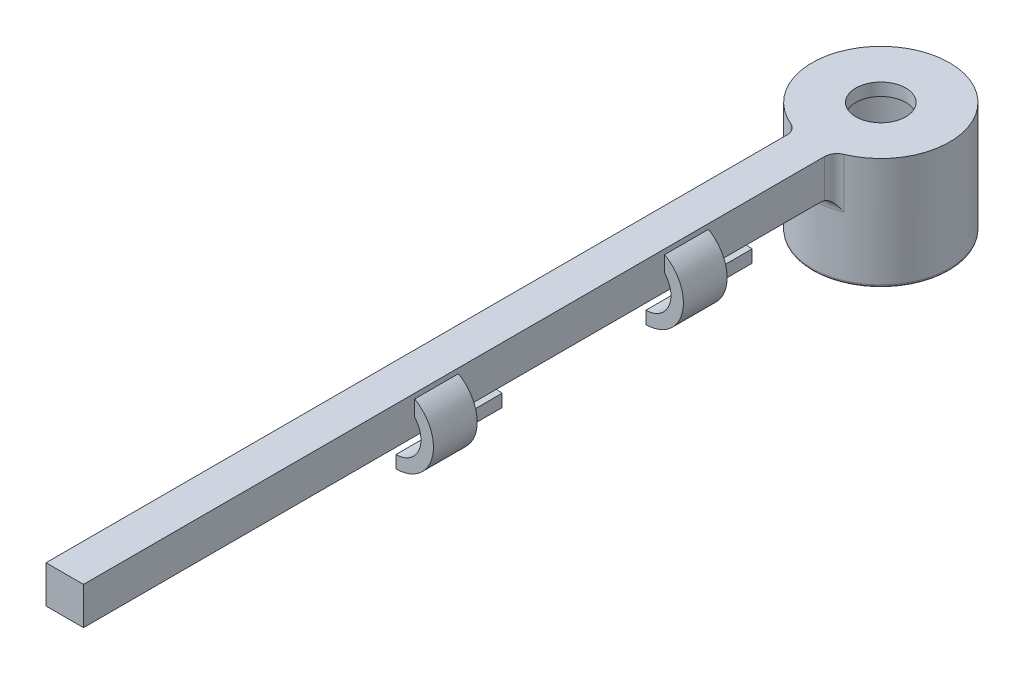
ISO-10303-21;
HEADER;
FILE_DESCRIPTION(('STEP AP214'),'2;1');
FILE_NAME('part.step','',(''),(''),'','','');
FILE_SCHEMA(('AUTOMOTIVE_DESIGN { 1 0 10303 214 1 1 1 1 }'));
ENDSEC;
DATA;
#1=APPLICATION_CONTEXT('core data for automotive mechanical design processes');
#2=APPLICATION_PROTOCOL_DEFINITION('international standard','automotive_design',2000,#1);
#3=PRODUCT_CONTEXT('',#1,'mechanical');
#4=PRODUCT('Part','Part','',(#3));
#5=PRODUCT_RELATED_PRODUCT_CATEGORY('part','',(#4));
#6=PRODUCT_DEFINITION_FORMATION('','',#4);
#7=PRODUCT_DEFINITION_CONTEXT('part definition',#1,'design');
#8=PRODUCT_DEFINITION('design','',#6,#7);
#9=PRODUCT_DEFINITION_SHAPE('','',#8);
#10=(LENGTH_UNIT() NAMED_UNIT(*) SI_UNIT(.MILLI.,.METRE.));
#11=(NAMED_UNIT(*) PLANE_ANGLE_UNIT() SI_UNIT($,.RADIAN.));
#12=(NAMED_UNIT(*) SI_UNIT($,.STERADIAN.) SOLID_ANGLE_UNIT());
#13=UNCERTAINTY_MEASURE_WITH_UNIT(LENGTH_MEASURE(1.E-05),#10,'distance_accuracy_value','');
#14=(GEOMETRIC_REPRESENTATION_CONTEXT(3) GLOBAL_UNCERTAINTY_ASSIGNED_CONTEXT((#13)) GLOBAL_UNIT_ASSIGNED_CONTEXT((#10,
#11,#12)) REPRESENTATION_CONTEXT('',''));
#15=CARTESIAN_POINT('',(0.,0.,0.));
#16=DIRECTION('',(0.,0.,1.));
#17=DIRECTION('',(1.,0.,0.));
#18=AXIS2_PLACEMENT_3D('',#15,#16,#17);
#19=CARTESIAN_POINT('',(0.,-9.,0.));
#20=DIRECTION('',(0.,1.,0.));
#21=DIRECTION('',(0.,0.,1.));
#22=AXIS2_PLACEMENT_3D('',#19,#20,#21);
#23=CYLINDRICAL_SURFACE('',#22,5.5);
#24=CARTESIAN_POINT('',(0.,-8.75,0.));
#25=DIRECTION('',(0.,1.,0.));
#26=DIRECTION('',(0.,0.,1.));
#27=AXIS2_PLACEMENT_3D('',#24,#25,#26);
#28=CIRCLE('',#27,5.5);
#29=CARTESIAN_POINT('',(0.,-8.75,5.5));
#30=VERTEX_POINT('',#29);
#31=EDGE_CURVE('E401',#30,#30,#28,.T.);
#32=ORIENTED_EDGE('',*,*,#31,.T.);
#33=EDGE_LOOP('',(#32));
#34=FACE_BOUND('',#33,.T.);
#35=DIRECTION('',(0.,1.,0.));
#36=VECTOR('',#35,1.);
#37=CARTESIAN_POINT('',(2.11538461538462,-9.,5.07692307692308));
#38=LINE('',#37,#36);
#39=CARTESIAN_POINT('',(2.11538461538462,0.,5.07692307692308));
#40=VERTEX_POINT('',#39);
#41=CARTESIAN_POINT('',(2.11538461538462,-4.,5.07692307692308));
#42=VERTEX_POINT('',#41);
#43=EDGE_CURVE('E313',#40,#42,#38,.F.);
#44=ORIENTED_EDGE('',*,*,#43,.T.);
#45=CARTESIAN_POINT('',(0.,-4.,0.));
#46=DIRECTION('',(0.,-1.,0.));
#47=DIRECTION('',(0.,0.,-1.));
#48=AXIS2_PLACEMENT_3D('',#45,#46,#47);
#49=CIRCLE('',#48,5.5);
#50=CARTESIAN_POINT('',(-2.11538461538461,-4.,5.07692307692308));
#51=VERTEX_POINT('',#50);
#52=EDGE_CURVE('E326',#42,#51,#49,.T.);
#53=ORIENTED_EDGE('',*,*,#52,.T.);
#54=DIRECTION('',(0.,1.,0.));
#55=VECTOR('',#54,1.);
#56=CARTESIAN_POINT('',(-2.11538461538461,-9.,5.07692307692308));
#57=LINE('',#56,#55);
#58=CARTESIAN_POINT('',(-2.11538461538461,0.,5.07692307692308));
#59=VERTEX_POINT('',#58);
#60=EDGE_CURVE('E319',#51,#59,#57,.T.);
#61=ORIENTED_EDGE('',*,*,#60,.T.);
#62=CARTESIAN_POINT('',(0.,0.,0.));
#63=DIRECTION('',(0.,1.,0.));
#64=DIRECTION('',(0.,0.,1.));
#65=AXIS2_PLACEMENT_3D('',#62,#63,#64);
#66=CIRCLE('',#65,5.5);
#67=EDGE_CURVE('E307',#40,#59,#66,.T.);
#68=ORIENTED_EDGE('',*,*,#67,.F.);
#69=EDGE_LOOP('',(#44,#53,#61,#68));
#70=FACE_BOUND('',#69,.T.);
#71=ADVANCED_FACE('F33',(#34,#70),#23,.T.);
#72=CARTESIAN_POINT('',(0.,-9.,0.));
#73=DIRECTION('',(0.,1.,0.));
#74=DIRECTION('',(0.,0.,1.));
#75=AXIS2_PLACEMENT_3D('',#72,#73,#74);
#76=PLANE('',#75);
#77=CARTESIAN_POINT('',(0.,-9.,0.));
#78=DIRECTION('',(0.,1.,0.));
#79=DIRECTION('',(0.,0.,1.));
#80=AXIS2_PLACEMENT_3D('',#77,#78,#79);
#81=CIRCLE('',#80,4.63);
#82=CARTESIAN_POINT('',(0.,-9.,4.63));
#83=VERTEX_POINT('',#82);
#84=EDGE_CURVE('E410',#83,#83,#81,.T.);
#85=ORIENTED_EDGE('',*,*,#84,.T.);
#86=EDGE_LOOP('',(#85));
#87=FACE_BOUND('',#86,.T.);
#88=CARTESIAN_POINT('',(0.,-9.,0.));
#89=DIRECTION('',(0.,1.,0.));
#90=DIRECTION('',(0.,0.,1.));
#91=AXIS2_PLACEMENT_3D('',#88,#89,#90);
#92=CIRCLE('',#91,5.25);
#93=CARTESIAN_POINT('',(0.,-9.,5.25));
#94=VERTEX_POINT('',#93);
#95=EDGE_CURVE('E404',#94,#94,#92,.F.);
#96=ORIENTED_EDGE('',*,*,#95,.T.);
#97=EDGE_LOOP('',(#96));
#98=FACE_BOUND('',#97,.T.);
#99=ADVANCED_FACE('F373',(#87,#98),#76,.F.);
#100=CARTESIAN_POINT('',(0.,0.,0.));
#101=DIRECTION('',(0.,1.,0.));
#102=DIRECTION('',(0.,0.,1.));
#103=AXIS2_PLACEMENT_3D('',#100,#101,#102);
#104=PLANE('',#103);
#105=DIRECTION('',(0.,0.,-1.));
#106=VECTOR('',#105,1.);
#107=CARTESIAN_POINT('',(1.5,0.,5.29150262212918));
#108=LINE('',#107,#106);
#109=CARTESIAN_POINT('',(1.5,0.,65.2915026221292));
#110=VERTEX_POINT('',#109);
#111=CARTESIAN_POINT('',(1.5,0.,6.));
#112=VERTEX_POINT('',#111);
#113=EDGE_CURVE('E289',#110,#112,#108,.T.);
#114=ORIENTED_EDGE('',*,*,#113,.T.);
#115=CARTESIAN_POINT('',(2.5,0.,6.));
#116=DIRECTION('',(0.,1.,0.));
#117=DIRECTION('',(0.,0.,1.));
#118=AXIS2_PLACEMENT_3D('',#115,#116,#117);
#119=CIRCLE('',#118,1.);
#120=EDGE_CURVE('E315',#112,#40,#119,.F.);
#121=ORIENTED_EDGE('',*,*,#120,.T.);
#122=ORIENTED_EDGE('',*,*,#67,.T.);
#123=CARTESIAN_POINT('',(-2.49999999999999,0.,6.));
#124=DIRECTION('',(0.,1.,0.));
#125=DIRECTION('',(0.,0.,1.));
#126=AXIS2_PLACEMENT_3D('',#123,#124,#125);
#127=CIRCLE('',#126,1.);
#128=CARTESIAN_POINT('',(-1.49999999999999,0.,6.));
#129=VERTEX_POINT('',#128);
#130=EDGE_CURVE('E321',#59,#129,#127,.F.);
#131=ORIENTED_EDGE('',*,*,#130,.T.);
#132=DIRECTION('',(0.,0.,1.));
#133=VECTOR('',#132,1.);
#134=CARTESIAN_POINT('',(-1.49999999999999,0.,5.29150262212918));
#135=LINE('',#134,#133);
#136=CARTESIAN_POINT('',(-1.49999999999999,0.,65.2915026221292));
#137=VERTEX_POINT('',#136);
#138=EDGE_CURVE('E281',#129,#137,#135,.T.);
#139=ORIENTED_EDGE('',*,*,#138,.T.);
#140=DIRECTION('',(1.,0.,0.));
#141=VECTOR('',#140,1.);
#142=CARTESIAN_POINT('',(-1.49999999999999,0.,65.2915026221292));
#143=LINE('',#142,#141);
#144=EDGE_CURVE('E276',#137,#110,#143,.T.);
#145=ORIENTED_EDGE('',*,*,#144,.T.);
#146=EDGE_LOOP('',(#114,#121,#122,#131,#139,#145));
#147=FACE_BOUND('',#146,.T.);
#148=CARTESIAN_POINT('',(0.,0.,0.));
#149=DIRECTION('',(0.,1.,0.));
#150=DIRECTION('',(0.,0.,1.));
#151=AXIS2_PLACEMENT_3D('',#148,#149,#150);
#152=CIRCLE('',#151,2.);
#153=CARTESIAN_POINT('',(0.,0.,2.));
#154=VERTEX_POINT('',#153);
#155=EDGE_CURVE('E296',#154,#154,#152,.T.);
#156=ORIENTED_EDGE('',*,*,#155,.F.);
#157=EDGE_LOOP('',(#156));
#158=FACE_BOUND('',#157,.T.);
#159=ADVANCED_FACE('F371',(#147,#158),#104,.T.);
#160=CARTESIAN_POINT('',(0.,-0.999999999999999,0.));
#161=DIRECTION('',(0.,-1.,0.));
#162=DIRECTION('',(0.,0.,-1.));
#163=AXIS2_PLACEMENT_3D('',#160,#161,#162);
#164=CYLINDRICAL_SURFACE('',#163,4.38);
#165=CARTESIAN_POINT('',(0.,-8.75,0.));
#166=DIRECTION('',(0.,1.,0.));
#167=DIRECTION('',(0.,0.,1.));
#168=AXIS2_PLACEMENT_3D('',#165,#166,#167);
#169=CIRCLE('',#168,4.38);
#170=CARTESIAN_POINT('',(0.,-8.75,4.38));
#171=VERTEX_POINT('',#170);
#172=EDGE_CURVE('E407',#171,#171,#169,.F.);
#173=ORIENTED_EDGE('',*,*,#172,.T.);
#174=EDGE_LOOP('',(#173));
#175=FACE_BOUND('',#174,.T.);
#176=CARTESIAN_POINT('',(0.,-0.999999999999999,0.));
#177=DIRECTION('',(0.,-1.,0.));
#178=DIRECTION('',(0.,0.,-1.));
#179=AXIS2_PLACEMENT_3D('',#176,#177,#178);
#180=CIRCLE('',#179,4.38);
#181=CARTESIAN_POINT('',(0.,-0.999999999999999,-4.38));
#182=VERTEX_POINT('',#181);
#183=EDGE_CURVE('E302',#182,#182,#180,.T.);
#184=ORIENTED_EDGE('',*,*,#183,.F.);
#185=EDGE_LOOP('',(#184));
#186=FACE_BOUND('',#185,.T.);
#187=ADVANCED_FACE('F367',(#175,#186),#164,.F.);
#188=CARTESIAN_POINT('',(0.,-0.999999999999999,0.));
#189=DIRECTION('',(0.,-1.,0.));
#190=DIRECTION('',(0.,0.,-1.));
#191=AXIS2_PLACEMENT_3D('',#188,#189,#190);
#192=PLANE('',#191);
#193=CARTESIAN_POINT('',(0.,-1.,0.));
#194=DIRECTION('',(0.,1.,0.));
#195=DIRECTION('',(0.,0.,1.));
#196=AXIS2_PLACEMENT_3D('',#193,#194,#195);
#197=CIRCLE('',#196,2.);
#198=CARTESIAN_POINT('',(0.,-1.,2.));
#199=VERTEX_POINT('',#198);
#200=EDGE_CURVE('E299',#199,#199,#197,.T.);
#201=ORIENTED_EDGE('',*,*,#200,.T.);
#202=EDGE_LOOP('',(#201));
#203=FACE_BOUND('',#202,.T.);
#204=ORIENTED_EDGE('',*,*,#183,.T.);
#205=EDGE_LOOP('',(#204));
#206=FACE_BOUND('',#205,.T.);
#207=ADVANCED_FACE('F363',(#203,#206),#192,.T.);
#208=CARTESIAN_POINT('',(0.,-1.,0.));
#209=DIRECTION('',(0.,1.,0.));
#210=DIRECTION('',(0.,0.,1.));
#211=AXIS2_PLACEMENT_3D('',#208,#209,#210);
#212=CYLINDRICAL_SURFACE('',#211,2.);
#213=ORIENTED_EDGE('',*,*,#200,.F.);
#214=EDGE_LOOP('',(#213));
#215=FACE_BOUND('',#214,.T.);
#216=ORIENTED_EDGE('',*,*,#155,.T.);
#217=EDGE_LOOP('',(#216));
#218=FACE_BOUND('',#217,.T.);
#219=ADVANCED_FACE('F359',(#215,#218),#212,.F.);
#220=CARTESIAN_POINT('',(-1.49999999999999,-3.,65.2915026221292));
#221=DIRECTION('',(0.,0.,1.));
#222=DIRECTION('',(1.,0.,0.));
#223=AXIS2_PLACEMENT_3D('',#220,#221,#222);
#224=PLANE('',#223);
#225=ORIENTED_EDGE('',*,*,#144,.F.);
#226=DIRECTION('',(0.,1.,0.));
#227=VECTOR('',#226,1.);
#228=CARTESIAN_POINT('',(-1.49999999999999,-3.,65.2915026221292));
#229=LINE('',#228,#227);
#230=CARTESIAN_POINT('',(-1.49999999999999,-3.,65.2915026221292));
#231=VERTEX_POINT('',#230);
#232=EDGE_CURVE('E293',#231,#137,#229,.T.);
#233=ORIENTED_EDGE('',*,*,#232,.F.);
#234=DIRECTION('',(1.,0.,0.));
#235=VECTOR('',#234,1.);
#236=CARTESIAN_POINT('',(-1.49999999999999,-3.,65.2915026221292));
#237=LINE('',#236,#235);
#238=CARTESIAN_POINT('',(1.5,-3.,65.2915026221292));
#239=VERTEX_POINT('',#238);
#240=EDGE_CURVE('E277',#231,#239,#237,.T.);
#241=ORIENTED_EDGE('',*,*,#240,.T.);
#242=DIRECTION('',(0.,1.,0.));
#243=VECTOR('',#242,1.);
#244=CARTESIAN_POINT('',(1.5,-3.,65.2915026221292));
#245=LINE('',#244,#243);
#246=EDGE_CURVE('E286',#239,#110,#245,.T.);
#247=ORIENTED_EDGE('',*,*,#246,.T.);
#248=EDGE_LOOP('',(#225,#233,#241,#247));
#249=FACE_BOUND('',#248,.T.);
#250=ADVANCED_FACE('F356',(#249),#224,.T.);
#251=CARTESIAN_POINT('',(-1.49999999999999,-3.,5.29150262212918));
#252=DIRECTION('',(-1.,0.,0.));
#253=DIRECTION('',(0.,0.,1.));
#254=AXIS2_PLACEMENT_3D('',#251,#252,#253);
#255=PLANE('',#254);
#256=DIRECTION('',(0.,1.,0.));
#257=VECTOR('',#256,1.);
#258=CARTESIAN_POINT('',(-1.49999999999999,-3.,33.7915026221292));
#259=LINE('',#258,#257);
#260=CARTESIAN_POINT('',(-1.49999999999999,-1.6771243444677,33.7915026221292));
#261=VERTEX_POINT('',#260);
#262=CARTESIAN_POINT('',(-1.49999999999999,-0.401923788646679,33.7915026221292));
#263=VERTEX_POINT('',#262);
#264=EDGE_CURVE('E11',#261,#263,#259,.T.);
#265=ORIENTED_EDGE('',*,*,#264,.F.);
#266=DIRECTION('',(0.,0.,-1.));
#267=VECTOR('',#266,1.);
#268=CARTESIAN_POINT('',(-1.49999999999999,-1.6771243444677,33.7915026221292));
#269=LINE('',#268,#267);
#270=CARTESIAN_POINT('',(-1.49999999999999,-1.6771243444677,30.2915026221292));
#271=VERTEX_POINT('',#270);
#272=EDGE_CURVE('E41',#261,#271,#269,.T.);
#273=ORIENTED_EDGE('',*,*,#272,.T.);
#274=DIRECTION('',(0.,1.,0.));
#275=VECTOR('',#274,1.);
#276=CARTESIAN_POINT('',(-1.49999999999999,-3.,30.2915026221292));
#277=LINE('',#276,#275);
#278=CARTESIAN_POINT('',(-1.49999999999999,-0.401923788646679,30.2915026221292));
#279=VERTEX_POINT('',#278);
#280=EDGE_CURVE('E446',#271,#279,#277,.T.);
#281=ORIENTED_EDGE('',*,*,#280,.T.);
#282=DIRECTION('',(0.,0.,-1.));
#283=VECTOR('',#282,1.);
#284=CARTESIAN_POINT('',(-1.49999999999999,-0.401923788646679,33.7915026221292));
#285=LINE('',#284,#283);
#286=EDGE_CURVE('E449',#279,#263,#285,.F.);
#287=ORIENTED_EDGE('',*,*,#286,.T.);
#288=EDGE_LOOP('',(#265,#273,#281,#287));
#289=FACE_BOUND('',#288,.T.);
#290=DIRECTION('',(0.,1.,0.));
#291=VECTOR('',#290,1.);
#292=CARTESIAN_POINT('',(-1.49999999999999,-3.,13.7915026221292));
#293=LINE('',#292,#291);
#294=CARTESIAN_POINT('',(-1.49999999999999,-1.6771243444677,13.7915026221292));
#295=VERTEX_POINT('',#294);
#296=CARTESIAN_POINT('',(-1.49999999999999,-0.401923788646681,13.7915026221292));
#297=VERTEX_POINT('',#296);
#298=EDGE_CURVE('E422',#295,#297,#293,.T.);
#299=ORIENTED_EDGE('',*,*,#298,.F.);
#300=DIRECTION('',(0.,0.,-1.));
#301=VECTOR('',#300,1.);
#302=CARTESIAN_POINT('',(-1.49999999999999,-1.6771243444677,13.7915026221292));
#303=LINE('',#302,#301);
#304=CARTESIAN_POINT('',(-1.49999999999999,-1.6771243444677,10.2915026221292));
#305=VERTEX_POINT('',#304);
#306=EDGE_CURVE('E419',#295,#305,#303,.T.);
#307=ORIENTED_EDGE('',*,*,#306,.T.);
#308=DIRECTION('',(0.,1.,0.));
#309=VECTOR('',#308,1.);
#310=CARTESIAN_POINT('',(-1.49999999999999,-3.,10.2915026221292));
#311=LINE('',#310,#309);
#312=CARTESIAN_POINT('',(-1.49999999999999,-0.401923788646681,10.2915026221292));
#313=VERTEX_POINT('',#312);
#314=EDGE_CURVE('E413',#305,#313,#311,.T.);
#315=ORIENTED_EDGE('',*,*,#314,.T.);
#316=DIRECTION('',(0.,0.,-1.));
#317=VECTOR('',#316,1.);
#318=CARTESIAN_POINT('',(-1.49999999999999,-0.401923788646681,13.7915026221292));
#319=LINE('',#318,#317);
#320=EDGE_CURVE('E416',#313,#297,#319,.F.);
#321=ORIENTED_EDGE('',*,*,#320,.T.);
#322=EDGE_LOOP('',(#299,#307,#315,#321));
#323=FACE_BOUND('',#322,.T.);
#324=ORIENTED_EDGE('',*,*,#138,.F.);
#325=DIRECTION('',(0.,-1.,0.));
#326=VECTOR('',#325,1.);
#327=CARTESIAN_POINT('',(-1.49999999999999,-3.,6.));
#328=LINE('',#327,#326);
#329=CARTESIAN_POINT('',(-1.49999999999999,-3.05102176023663,6.));
#330=VERTEX_POINT('',#329);
#331=EDGE_CURVE('E317',#129,#330,#328,.T.);
#332=ORIENTED_EDGE('',*,*,#331,.T.);
#333=CARTESIAN_POINT('',(-1.49999999999999,-3.05102176023663,6.));
#334=CARTESIAN_POINT('',(-1.49999999999999,-3.03406974968747,6.05276391951299));
#335=CARTESIAN_POINT('',(-1.49999999999999,-3.02134193130793,6.10619190673131));
#336=CARTESIAN_POINT('',(-1.49999999999999,-3.00433452591979,6.21437698961873));
#337=CARTESIAN_POINT('',(-1.49999999999999,-3.00005509088712,6.26913410917932));
#338=CARTESIAN_POINT('',(-1.49999999999999,-3.,6.32455532033676));
#339=B_SPLINE_CURVE_WITH_KNOTS('',3,(#333,#334,#335,#336,#337,#338),.UNSPECIFIED.,.F.,.F.,(4,2,
4),(0.,0.164769307245432,0.329541578459206),.UNSPECIFIED.);
#340=CARTESIAN_POINT('',(-1.49999999999999,-3.,6.32455532033676));
#341=VERTEX_POINT('',#340);
#342=EDGE_CURVE('E396',#330,#341,#339,.T.);
#343=ORIENTED_EDGE('',*,*,#342,.T.);
#344=DIRECTION('',(0.,0.,1.));
#345=VECTOR('',#344,1.);
#346=CARTESIAN_POINT('',(-1.49999999999999,-3.,5.29150262212918));
#347=LINE('',#346,#345);
#348=EDGE_CURVE('E284',#341,#231,#347,.T.);
#349=ORIENTED_EDGE('',*,*,#348,.T.);
#350=ORIENTED_EDGE('',*,*,#232,.T.);
#351=EDGE_LOOP('',(#324,#332,#343,#349,#350));
#352=FACE_BOUND('',#351,.T.);
#353=ADVANCED_FACE('F352',(#289,#323,#352),#255,.T.);
#354=CARTESIAN_POINT('',(1.5,-3.,5.29150262212918));
#355=DIRECTION('',(1.,0.,0.));
#356=DIRECTION('',(0.,0.,-1.));
#357=AXIS2_PLACEMENT_3D('',#354,#355,#356);
#358=PLANE('',#357);
#359=DIRECTION('',(0.,-1.,0.));
#360=VECTOR('',#359,1.);
#361=CARTESIAN_POINT('',(1.5,-3.,18.7915026221292));
#362=LINE('',#361,#360);
#363=CARTESIAN_POINT('',(1.5,-0.401923788646684,18.7915026221292));
#364=VERTEX_POINT('',#363);
#365=CARTESIAN_POINT('',(1.5,-1.67712434446771,18.7915026221292));
#366=VERTEX_POINT('',#365);
#367=EDGE_CURVE('E444',#364,#366,#362,.T.);
#368=ORIENTED_EDGE('',*,*,#367,.F.);
#369=DIRECTION('',(0.,0.,-1.));
#370=VECTOR('',#369,1.);
#371=CARTESIAN_POINT('',(1.5,-0.401923788646684,18.7915026221292));
#372=LINE('',#371,#370);
#373=CARTESIAN_POINT('',(1.5,-0.401923788646684,15.2915026221292));
#374=VERTEX_POINT('',#373);
#375=EDGE_CURVE('E438',#364,#374,#372,.T.);
#376=ORIENTED_EDGE('',*,*,#375,.T.);
#377=DIRECTION('',(0.,-1.,0.));
#378=VECTOR('',#377,1.);
#379=CARTESIAN_POINT('',(1.5,-3.,15.2915026221292));
#380=LINE('',#379,#378);
#381=CARTESIAN_POINT('',(1.5,-1.67712434446771,15.2915026221292));
#382=VERTEX_POINT('',#381);
#383=EDGE_CURVE('E435',#374,#382,#380,.T.);
#384=ORIENTED_EDGE('',*,*,#383,.T.);
#385=DIRECTION('',(0.,0.,-1.));
#386=VECTOR('',#385,1.);
#387=CARTESIAN_POINT('',(1.5,-1.67712434446771,18.7915026221292));
#388=LINE('',#387,#386);
#389=EDGE_CURVE('E441',#382,#366,#388,.F.);
#390=ORIENTED_EDGE('',*,*,#389,.T.);
#391=EDGE_LOOP('',(#368,#376,#384,#390));
#392=FACE_BOUND('',#391,.T.);
#393=DIRECTION('',(0.,-1.,0.));
#394=VECTOR('',#393,1.);
#395=CARTESIAN_POINT('',(1.5,-3.,38.7915026221292));
#396=LINE('',#395,#394);
#397=CARTESIAN_POINT('',(1.5,-0.401923788646684,38.7915026221292));
#398=VERTEX_POINT('',#397);
#399=CARTESIAN_POINT('',(1.5,-1.6771243444677,38.7915026221292));
#400=VERTEX_POINT('',#399);
#401=EDGE_CURVE('E433',#398,#400,#396,.T.);
#402=ORIENTED_EDGE('',*,*,#401,.F.);
#403=DIRECTION('',(0.,0.,-1.));
#404=VECTOR('',#403,1.);
#405=CARTESIAN_POINT('',(1.5,-0.401923788646684,38.7915026221292));
#406=LINE('',#405,#404);
#407=CARTESIAN_POINT('',(1.5,-0.401923788646684,35.2915026221292));
#408=VERTEX_POINT('',#407);
#409=EDGE_CURVE('E427',#398,#408,#406,.T.);
#410=ORIENTED_EDGE('',*,*,#409,.T.);
#411=DIRECTION('',(0.,-1.,0.));
#412=VECTOR('',#411,1.);
#413=CARTESIAN_POINT('',(1.5,-3.,35.2915026221292));
#414=LINE('',#413,#412);
#415=CARTESIAN_POINT('',(1.5,-1.6771243444677,35.2915026221292));
#416=VERTEX_POINT('',#415);
#417=EDGE_CURVE('E424',#408,#416,#414,.T.);
#418=ORIENTED_EDGE('',*,*,#417,.T.);
#419=DIRECTION('',(0.,0.,-1.));
#420=VECTOR('',#419,1.);
#421=CARTESIAN_POINT('',(1.5,-1.6771243444677,38.7915026221292));
#422=LINE('',#421,#420);
#423=EDGE_CURVE('E430',#416,#400,#422,.F.);
#424=ORIENTED_EDGE('',*,*,#423,.T.);
#425=EDGE_LOOP('',(#402,#410,#418,#424));
#426=FACE_BOUND('',#425,.T.);
#427=DIRECTION('',(0.,0.,-1.));
#428=VECTOR('',#427,1.);
#429=CARTESIAN_POINT('',(1.5,-3.,5.29150262212918));
#430=LINE('',#429,#428);
#431=CARTESIAN_POINT('',(1.5,-3.,6.32455532033676));
#432=VERTEX_POINT('',#431);
#433=EDGE_CURVE('E280',#239,#432,#430,.T.);
#434=ORIENTED_EDGE('',*,*,#433,.T.);
#435=CARTESIAN_POINT('',(1.5,-3.,6.32455532033676));
#436=CARTESIAN_POINT('',(1.5,-3.00005509088712,6.26913410917932));
#437=CARTESIAN_POINT('',(1.5,-3.00433452591979,6.21437698961873));
#438=CARTESIAN_POINT('',(1.5,-3.02134193130793,6.10619190673131));
#439=CARTESIAN_POINT('',(1.5,-3.03406974968747,6.05276391951298));
#440=CARTESIAN_POINT('',(1.5,-3.05102176023663,6.));
#441=B_SPLINE_CURVE_WITH_KNOTS('',3,(#435,#436,#437,#438,#439,#440),.UNSPECIFIED.,.F.,.F.,(4,2,
4),(0.,0.164772271213777,0.32954157845921),.UNSPECIFIED.);
#442=CARTESIAN_POINT('',(1.5,-3.05102176023663,6.));
#443=VERTEX_POINT('',#442);
#444=EDGE_CURVE('E329',#432,#443,#441,.T.);
#445=ORIENTED_EDGE('',*,*,#444,.T.);
#446=DIRECTION('',(0.,-1.,0.));
#447=VECTOR('',#446,1.);
#448=CARTESIAN_POINT('',(1.5,0.,6.));
#449=LINE('',#448,#447);
#450=EDGE_CURVE('E310',#443,#112,#449,.F.);
#451=ORIENTED_EDGE('',*,*,#450,.T.);
#452=ORIENTED_EDGE('',*,*,#113,.F.);
#453=ORIENTED_EDGE('',*,*,#246,.F.);
#454=EDGE_LOOP('',(#434,#445,#451,#452,#453));
#455=FACE_BOUND('',#454,.T.);
#456=ADVANCED_FACE('F346',(#392,#426,#455),#358,.T.);
#457=CARTESIAN_POINT('',(-0.0105594343899873,-3.,-0.286754057259299));
#458=DIRECTION('',(0.,-1.,0.));
#459=DIRECTION('',(0.,0.,-1.));
#460=AXIS2_PLACEMENT_3D('',#457,#458,#459);
#461=PLANE('',#460);
#462=ORIENTED_EDGE('',*,*,#348,.F.);
#463=CARTESIAN_POINT('',(0.,-3.,0.));
#464=DIRECTION('',(0.,-1.,0.));
#465=DIRECTION('',(0.,0.,-1.));
#466=AXIS2_PLACEMENT_3D('',#463,#464,#465);
#467=CIRCLE('',#466,6.5);
#468=EDGE_CURVE('E323',#341,#432,#467,.F.);
#469=ORIENTED_EDGE('',*,*,#468,.T.);
#470=ORIENTED_EDGE('',*,*,#433,.F.);
#471=ORIENTED_EDGE('',*,*,#240,.F.);
#472=EDGE_LOOP('',(#462,#469,#470,#471));
#473=FACE_BOUND('',#472,.T.);
#474=ADVANCED_FACE('F351',(#473),#461,.T.);
#475=CARTESIAN_POINT('',(2.5,-9.,6.));
#476=DIRECTION('',(0.,1.,0.));
#477=DIRECTION('',(0.,0.,1.));
#478=AXIS2_PLACEMENT_3D('',#475,#476,#477);
#479=CYLINDRICAL_SURFACE('',#478,1.);
#480=ORIENTED_EDGE('',*,*,#450,.F.);
#481=CARTESIAN_POINT('',(1.5,-3.05102176023663,6.));
#482=CARTESIAN_POINT('',(1.49999719902262,-3.0684458523044,5.94586472167182));
#483=CARTESIAN_POINT('',(1.50438456628936,-3.08984290094301,5.89341637606796));
#484=CARTESIAN_POINT('',(1.5203024208252,-3.13859130977469,5.79331194805032));
#485=CARTESIAN_POINT('',(1.53174050887214,-3.16586272640564,5.74560299973876));
#486=CARTESIAN_POINT('',(1.56417947771397,-3.23315313117927,5.64230039723698));
#487=CARTESIAN_POINT('',(1.58695967855335,-3.27460456383148,5.58823039263899));
#488=CARTESIAN_POINT('',(1.63935526495356,-3.36258095165774,5.48762598108026));
#489=CARTESIAN_POINT('',(1.66901490834403,-3.40913768197743,5.44114383849935));
#490=CARTESIAN_POINT('',(1.74789118369545,-3.52703241001769,5.33639931071978));
#491=CARTESIAN_POINT('',(1.79990819084686,-3.60010818933876,5.28222393904641));
#492=CARTESIAN_POINT('',(1.91144187885659,-3.74923177247216,5.18827241839595));
#493=CARTESIAN_POINT('',(1.97094400852389,-3.82527361748143,5.14846889623919));
#494=CARTESIAN_POINT('',(2.05895247323203,-3.93286423068571,5.10205596005287));
#495=CARTESIAN_POINT('',(2.08495550634361,-3.96410359681272,5.08974514419146));
#496=CARTESIAN_POINT('',(2.11275086888095,-3.9968968336274,5.07802377968282));
#497=CARTESIAN_POINT('',(2.11406715499667,-3.99844841763109,5.07747201710072));
#498=CARTESIAN_POINT('',(2.11538461538462,-4.,5.07692307692308));
#499=B_SPLINE_CURVE_WITH_KNOTS('',3,(#481,#482,#483,#484,#485,#486,#487,#488,#489,#490,#491,
#492,#493,#494,#495,#496,#497,#498),.UNSPECIFIED.,.F.,.F.,(4,2,2,2,2,2,2,2,4),(0.,
0.1697155467501,0.337252922773086,0.551620472821234,0.767407373446595,1.08012216542673,
1.39223816716043,1.51958578376324,1.52591034572664),.UNSPECIFIED.);
#500=EDGE_CURVE('E337',#443,#42,#499,.T.);
#501=ORIENTED_EDGE('',*,*,#500,.T.);
#502=ORIENTED_EDGE('',*,*,#43,.F.);
#503=ORIENTED_EDGE('',*,*,#120,.F.);
#504=EDGE_LOOP('',(#480,#501,#502,#503));
#505=FACE_BOUND('',#504,.T.);
#506=ADVANCED_FACE('F382',(#505),#479,.F.);
#507=CARTESIAN_POINT('',(-2.49999999999999,-9.,6.));
#508=DIRECTION('',(0.,1.,0.));
#509=DIRECTION('',(0.,0.,1.));
#510=AXIS2_PLACEMENT_3D('',#507,#508,#509);
#511=CYLINDRICAL_SURFACE('',#510,1.);
#512=ORIENTED_EDGE('',*,*,#130,.F.);
#513=ORIENTED_EDGE('',*,*,#60,.F.);
#514=CARTESIAN_POINT('',(-1.49999999999999,-3.05102176023663,6.));
#515=CARTESIAN_POINT('',(-1.49999719902261,-3.0684458523044,5.94586472167182));
#516=CARTESIAN_POINT('',(-1.50438456628936,-3.08984290094301,5.89341637606796));
#517=CARTESIAN_POINT('',(-1.52030242082519,-3.13859130977469,5.79331194805032));
#518=CARTESIAN_POINT('',(-1.53174050887213,-3.16586272640564,5.74560299973876));
#519=CARTESIAN_POINT('',(-1.56417947771396,-3.23315313117926,5.64230039723698));
#520=CARTESIAN_POINT('',(-1.58695967855334,-3.27460456383148,5.588230392639));
#521=CARTESIAN_POINT('',(-1.63935526495356,-3.36258095165774,5.48762598108026));
#522=CARTESIAN_POINT('',(-1.66901490834403,-3.40913768197742,5.44114383849935));
#523=CARTESIAN_POINT('',(-1.74789118369544,-3.52703241001769,5.33639931071979));
#524=CARTESIAN_POINT('',(-1.79990819084685,-3.60010818933877,5.28222393904641));
#525=CARTESIAN_POINT('',(-1.91144187885659,-3.74923177247215,5.18827241839595));
#526=CARTESIAN_POINT('',(-1.97094400852391,-3.8252736174814,5.14846889623918));
#527=CARTESIAN_POINT('',(-2.05895247323201,-3.93286423068572,5.10205596005288));
#528=CARTESIAN_POINT('',(-2.08495550634357,-3.96410359681275,5.08974514419148));
#529=CARTESIAN_POINT('',(-2.11275086888095,-3.99689683362741,5.07802377968282));
#530=CARTESIAN_POINT('',(-2.11406715499666,-3.99844841763109,5.07747201710072));
#531=CARTESIAN_POINT('',(-2.11538461538461,-4.,5.07692307692308));
#532=B_SPLINE_CURVE_WITH_KNOTS('',3,(#514,#515,#516,#517,#518,#519,#520,#521,#522,#523,#524,
#525,#526,#527,#528,#529,#530,#531),.UNSPECIFIED.,.F.,.F.,(4,2,2,2,2,2,2,2,4),(0.,
0.169715546750101,0.337252922773084,0.551620472821232,0.767407373446593,1.08012216542673,
1.39223816716043,1.51958578376324,1.52591034572664),.UNSPECIFIED.);
#533=EDGE_CURVE('E390',#51,#330,#532,.F.);
#534=ORIENTED_EDGE('',*,*,#533,.T.);
#535=ORIENTED_EDGE('',*,*,#331,.F.);
#536=EDGE_LOOP('',(#512,#513,#534,#535));
#537=FACE_BOUND('',#536,.T.);
#538=ADVANCED_FACE('F385',(#537),#511,.F.);
#539=CARTESIAN_POINT('',(0.,-4.,0.));
#540=DIRECTION('',(0.,-1.,0.));
#541=DIRECTION('',(0.,0.,-1.));
#542=AXIS2_PLACEMENT_3D('',#539,#540,#541);
#543=TOROIDAL_SURFACE('',#542,6.5,1.);
#544=ORIENTED_EDGE('',*,*,#533,.F.);
#545=ORIENTED_EDGE('',*,*,#52,.F.);
#546=ORIENTED_EDGE('',*,*,#500,.F.);
#547=ORIENTED_EDGE('',*,*,#444,.F.);
#548=ORIENTED_EDGE('',*,*,#468,.F.);
#549=ORIENTED_EDGE('',*,*,#342,.F.);
#550=EDGE_LOOP('',(#544,#545,#546,#547,#548,#549));
#551=FACE_BOUND('',#550,.T.);
#552=ADVANCED_FACE('F343',(#551),#543,.F.);
#553=CARTESIAN_POINT('',(0.,-8.75,0.));
#554=DIRECTION('',(0.,1.,0.));
#555=DIRECTION('',(0.,0.,1.));
#556=AXIS2_PLACEMENT_3D('',#553,#554,#555);
#557=TOROIDAL_SURFACE('',#556,5.25,0.25);
#558=ORIENTED_EDGE('',*,*,#95,.F.);
#559=EDGE_LOOP('',(#558));
#560=FACE_BOUND('',#559,.T.);
#561=ORIENTED_EDGE('',*,*,#31,.F.);
#562=EDGE_LOOP('',(#561));
#563=FACE_BOUND('',#562,.T.);
#564=ADVANCED_FACE('F655',(#560,#563),#557,.T.);
#565=CARTESIAN_POINT('',(0.,-8.75,0.));
#566=DIRECTION('',(0.,1.,0.));
#567=DIRECTION('',(0.,0.,1.));
#568=AXIS2_PLACEMENT_3D('',#565,#566,#567);
#569=TOROIDAL_SURFACE('',#568,4.63,0.25);
#570=ORIENTED_EDGE('',*,*,#84,.F.);
#571=EDGE_LOOP('',(#570));
#572=FACE_BOUND('',#571,.T.);
#573=ORIENTED_EDGE('',*,*,#172,.F.);
#574=EDGE_LOOP('',(#573));
#575=FACE_BOUND('',#574,.T.);
#576=ADVANCED_FACE('F35',(#572,#575),#569,.T.);
#577=CARTESIAN_POINT('',(0.,-3.,13.7915026221292));
#578=DIRECTION('',(0.,0.,-1.));
#579=DIRECTION('',(-1.,0.,0.));
#580=AXIS2_PLACEMENT_3D('',#577,#578,#579);
#581=CYLINDRICAL_SURFACE('',#580,2.);
#582=ORIENTED_EDGE('',*,*,#306,.F.);
#583=CARTESIAN_POINT('',(0.,-3.,13.7915026221292));
#584=DIRECTION('',(0.,0.,-1.));
#585=DIRECTION('',(1.,0.,0.));
#586=AXIS2_PLACEMENT_3D('',#583,#584,#585);
#587=CIRCLE('',#586,2.);
#588=CARTESIAN_POINT('',(0.,-5.,13.7915026221292));
#589=VERTEX_POINT('',#588);
#590=EDGE_CURVE('E257',#589,#295,#587,.T.);
#591=ORIENTED_EDGE('',*,*,#590,.F.);
#592=DIRECTION('',(0.,0.,-1.));
#593=VECTOR('',#592,1.);
#594=CARTESIAN_POINT('',(0.,-5.,13.7915026221292));
#595=LINE('',#594,#593);
#596=CARTESIAN_POINT('',(0.,-5.,10.2915026221292));
#597=VERTEX_POINT('',#596);
#598=EDGE_CURVE('E265',#589,#597,#595,.T.);
#599=ORIENTED_EDGE('',*,*,#598,.T.);
#600=CARTESIAN_POINT('',(0.,-3.,10.2915026221292));
#601=DIRECTION('',(0.,0.,-1.));
#602=DIRECTION('',(1.,0.,0.));
#603=AXIS2_PLACEMENT_3D('',#600,#601,#602);
#604=CIRCLE('',#603,2.);
#605=EDGE_CURVE('E256',#597,#305,#604,.T.);
#606=ORIENTED_EDGE('',*,*,#605,.T.);
#607=EDGE_LOOP('',(#582,#591,#599,#606));
#608=FACE_BOUND('',#607,.T.);
#609=ADVANCED_FACE('F524',(#608),#581,.F.);
#610=CARTESIAN_POINT('',(0.,-3.,13.7915026221292));
#611=DIRECTION('',(0.,0.,-1.));
#612=DIRECTION('',(-1.,0.,0.));
#613=AXIS2_PLACEMENT_3D('',#610,#611,#612);
#614=CYLINDRICAL_SURFACE('',#613,3.);
#615=ORIENTED_EDGE('',*,*,#320,.F.);
#616=CARTESIAN_POINT('',(0.,-3.,10.2915026221292));
#617=DIRECTION('',(0.,0.,1.));
#618=DIRECTION('',(1.,0.,0.));
#619=AXIS2_PLACEMENT_3D('',#616,#617,#618);
#620=CIRCLE('',#619,3.);
#621=CARTESIAN_POINT('',(0.,-6.,10.2915026221292));
#622=VERTEX_POINT('',#621);
#623=EDGE_CURVE('E268',#313,#622,#620,.T.);
#624=ORIENTED_EDGE('',*,*,#623,.T.);
#625=DIRECTION('',(0.,0.,-1.));
#626=VECTOR('',#625,1.);
#627=CARTESIAN_POINT('',(0.,-6.,13.7915026221292));
#628=LINE('',#627,#626);
#629=CARTESIAN_POINT('',(0.,-6.,13.7915026221292));
#630=VERTEX_POINT('',#629);
#631=EDGE_CURVE('E273',#630,#622,#628,.T.);
#632=ORIENTED_EDGE('',*,*,#631,.F.);
#633=CARTESIAN_POINT('',(0.,-3.,13.7915026221292));
#634=DIRECTION('',(0.,0.,1.));
#635=DIRECTION('',(1.,0.,0.));
#636=AXIS2_PLACEMENT_3D('',#633,#634,#635);
#637=CIRCLE('',#636,3.);
#638=EDGE_CURVE('E260',#297,#630,#637,.T.);
#639=ORIENTED_EDGE('',*,*,#638,.F.);
#640=EDGE_LOOP('',(#615,#624,#632,#639));
#641=FACE_BOUND('',#640,.T.);
#642=ADVANCED_FACE('F520',(#641),#614,.T.);
#643=CARTESIAN_POINT('',(0.,-5.,13.7915026221292));
#644=DIRECTION('',(-1.,0.,0.));
#645=DIRECTION('',(0.,-1.,0.));
#646=AXIS2_PLACEMENT_3D('',#643,#644,#645);
#647=PLANE('',#646);
#648=DIRECTION('',(0.,1.,0.));
#649=VECTOR('',#648,1.);
#650=CARTESIAN_POINT('',(0.,-5.,10.2915026221292));
#651=LINE('',#650,#649);
#652=EDGE_CURVE('E261',#622,#597,#651,.T.);
#653=ORIENTED_EDGE('',*,*,#652,.T.);
#654=ORIENTED_EDGE('',*,*,#598,.F.);
#655=DIRECTION('',(0.,1.,0.));
#656=VECTOR('',#655,1.);
#657=CARTESIAN_POINT('',(0.,-5.,13.7915026221292));
#658=LINE('',#657,#656);
#659=EDGE_CURVE('E263',#630,#589,#658,.T.);
#660=ORIENTED_EDGE('',*,*,#659,.F.);
#661=ORIENTED_EDGE('',*,*,#631,.T.);
#662=EDGE_LOOP('',(#653,#654,#660,#661));
#663=FACE_BOUND('',#662,.T.);
#664=ADVANCED_FACE('F513',(#663),#647,.F.);
#665=CARTESIAN_POINT('',(0.,-3.,13.7915026221292));
#666=DIRECTION('',(0.,0.,1.));
#667=DIRECTION('',(1.,0.,0.));
#668=AXIS2_PLACEMENT_3D('',#665,#666,#667);
#669=PLANE('',#668);
#670=ORIENTED_EDGE('',*,*,#590,.T.);
#671=ORIENTED_EDGE('',*,*,#298,.T.);
#672=ORIENTED_EDGE('',*,*,#638,.T.);
#673=ORIENTED_EDGE('',*,*,#659,.T.);
#674=EDGE_LOOP('',(#670,#671,#672,#673));
#675=FACE_BOUND('',#674,.T.);
#676=ADVANCED_FACE('F510',(#675),#669,.T.);
#677=CARTESIAN_POINT('',(0.,-3.,10.2915026221292));
#678=DIRECTION('',(0.,0.,1.));
#679=DIRECTION('',(1.,0.,0.));
#680=AXIS2_PLACEMENT_3D('',#677,#678,#679);
#681=PLANE('',#680);
#682=ORIENTED_EDGE('',*,*,#314,.F.);
#683=ORIENTED_EDGE('',*,*,#605,.F.);
#684=ORIENTED_EDGE('',*,*,#652,.F.);
#685=ORIENTED_EDGE('',*,*,#623,.F.);
#686=EDGE_LOOP('',(#682,#683,#684,#685));
#687=FACE_BOUND('',#686,.T.);
#688=ADVANCED_FACE('F508',(#687),#681,.F.);
#689=CARTESIAN_POINT('',(0.,-3.,38.7915026221292));
#690=DIRECTION('',(0.,0.,-1.));
#691=DIRECTION('',(-1.,0.,0.));
#692=AXIS2_PLACEMENT_3D('',#689,#690,#691);
#693=CYLINDRICAL_SURFACE('',#692,2.);
#694=ORIENTED_EDGE('',*,*,#423,.F.);
#695=CARTESIAN_POINT('',(0.,-3.,35.2915026221292));
#696=DIRECTION('',(0.,0.,-1.));
#697=DIRECTION('',(1.,0.,0.));
#698=AXIS2_PLACEMENT_3D('',#695,#696,#697);
#699=CIRCLE('',#698,2.);
#700=CARTESIAN_POINT('',(0.,-5.,35.2915026221292));
#701=VERTEX_POINT('',#700);
#702=EDGE_CURVE('E236',#416,#701,#699,.T.);
#703=ORIENTED_EDGE('',*,*,#702,.T.);
#704=DIRECTION('',(0.,0.,-1.));
#705=VECTOR('',#704,1.);
#706=CARTESIAN_POINT('',(0.,-5.,38.7915026221292));
#707=LINE('',#706,#705);
#708=CARTESIAN_POINT('',(0.,-5.,38.7915026221292));
#709=VERTEX_POINT('',#708);
#710=EDGE_CURVE('E253',#709,#701,#707,.T.);
#711=ORIENTED_EDGE('',*,*,#710,.F.);
#712=CARTESIAN_POINT('',(0.,-3.,38.7915026221292));
#713=DIRECTION('',(0.,0.,-1.));
#714=DIRECTION('',(1.,0.,0.));
#715=AXIS2_PLACEMENT_3D('',#712,#713,#714);
#716=CIRCLE('',#715,2.);
#717=EDGE_CURVE('E237',#400,#709,#716,.T.);
#718=ORIENTED_EDGE('',*,*,#717,.F.);
#719=EDGE_LOOP('',(#694,#703,#711,#718));
#720=FACE_BOUND('',#719,.T.);
#721=ADVANCED_FACE('F504',(#720),#693,.F.);
#722=CARTESIAN_POINT('',(0.,-5.,38.7915026221292));
#723=DIRECTION('',(1.,0.,0.));
#724=DIRECTION('',(0.,1.,0.));
#725=AXIS2_PLACEMENT_3D('',#722,#723,#724);
#726=PLANE('',#725);
#727=DIRECTION('',(0.,-1.,0.));
#728=VECTOR('',#727,1.);
#729=CARTESIAN_POINT('',(0.,-5.,35.2915026221292));
#730=LINE('',#729,#728);
#731=CARTESIAN_POINT('',(0.,-6.,35.2915026221292));
#732=VERTEX_POINT('',#731);
#733=EDGE_CURVE('E247',#701,#732,#730,.T.);
#734=ORIENTED_EDGE('',*,*,#733,.T.);
#735=DIRECTION('',(0.,0.,-1.));
#736=VECTOR('',#735,1.);
#737=CARTESIAN_POINT('',(0.,-6.,38.7915026221292));
#738=LINE('',#737,#736);
#739=CARTESIAN_POINT('',(0.,-6.,38.7915026221292));
#740=VERTEX_POINT('',#739);
#741=EDGE_CURVE('E245',#740,#732,#738,.T.);
#742=ORIENTED_EDGE('',*,*,#741,.F.);
#743=DIRECTION('',(0.,-1.,0.));
#744=VECTOR('',#743,1.);
#745=CARTESIAN_POINT('',(0.,-5.,38.7915026221292));
#746=LINE('',#745,#744);
#747=EDGE_CURVE('E239',#709,#740,#746,.T.);
#748=ORIENTED_EDGE('',*,*,#747,.F.);
#749=ORIENTED_EDGE('',*,*,#710,.T.);
#750=EDGE_LOOP('',(#734,#742,#748,#749));
#751=FACE_BOUND('',#750,.T.);
#752=ADVANCED_FACE('F500',(#751),#726,.F.);
#753=CARTESIAN_POINT('',(0.,-3.,38.7915026221292));
#754=DIRECTION('',(0.,0.,-1.));
#755=DIRECTION('',(-1.,0.,0.));
#756=AXIS2_PLACEMENT_3D('',#753,#754,#755);
#757=CYLINDRICAL_SURFACE('',#756,3.);
#758=ORIENTED_EDGE('',*,*,#409,.F.);
#759=CARTESIAN_POINT('',(0.,-3.,38.7915026221292));
#760=DIRECTION('',(0.,0.,1.));
#761=DIRECTION('',(1.,0.,0.));
#762=AXIS2_PLACEMENT_3D('',#759,#760,#761);
#763=CIRCLE('',#762,3.);
#764=EDGE_CURVE('E242',#740,#398,#763,.T.);
#765=ORIENTED_EDGE('',*,*,#764,.F.);
#766=ORIENTED_EDGE('',*,*,#741,.T.);
#767=CARTESIAN_POINT('',(0.,-3.,35.2915026221292));
#768=DIRECTION('',(0.,0.,1.));
#769=DIRECTION('',(1.,0.,0.));
#770=AXIS2_PLACEMENT_3D('',#767,#768,#769);
#771=CIRCLE('',#770,3.);
#772=EDGE_CURVE('E240',#732,#408,#771,.T.);
#773=ORIENTED_EDGE('',*,*,#772,.T.);
#774=EDGE_LOOP('',(#758,#765,#766,#773));
#775=FACE_BOUND('',#774,.T.);
#776=ADVANCED_FACE('F493',(#775),#757,.T.);
#777=CARTESIAN_POINT('',(0.,-3.,38.7915026221292));
#778=DIRECTION('',(0.,0.,1.));
#779=DIRECTION('',(1.,0.,0.));
#780=AXIS2_PLACEMENT_3D('',#777,#778,#779);
#781=PLANE('',#780);
#782=ORIENTED_EDGE('',*,*,#764,.T.);
#783=ORIENTED_EDGE('',*,*,#401,.T.);
#784=ORIENTED_EDGE('',*,*,#717,.T.);
#785=ORIENTED_EDGE('',*,*,#747,.T.);
#786=EDGE_LOOP('',(#782,#783,#784,#785));
#787=FACE_BOUND('',#786,.T.);
#788=ADVANCED_FACE('F490',(#787),#781,.T.);
#789=CARTESIAN_POINT('',(0.,-3.,35.2915026221292));
#790=DIRECTION('',(0.,0.,1.));
#791=DIRECTION('',(1.,0.,0.));
#792=AXIS2_PLACEMENT_3D('',#789,#790,#791);
#793=PLANE('',#792);
#794=ORIENTED_EDGE('',*,*,#417,.F.);
#795=ORIENTED_EDGE('',*,*,#772,.F.);
#796=ORIENTED_EDGE('',*,*,#733,.F.);
#797=ORIENTED_EDGE('',*,*,#702,.F.);
#798=EDGE_LOOP('',(#794,#795,#796,#797));
#799=FACE_BOUND('',#798,.T.);
#800=ADVANCED_FACE('F488',(#799),#793,.F.);
#801=CARTESIAN_POINT('',(0.,-3.,18.7915026221292));
#802=DIRECTION('',(0.,0.,-1.));
#803=DIRECTION('',(-1.,0.,0.));
#804=AXIS2_PLACEMENT_3D('',#801,#802,#803);
#805=CYLINDRICAL_SURFACE('',#804,2.);
#806=ORIENTED_EDGE('',*,*,#389,.F.);
#807=CARTESIAN_POINT('',(0.,-3.,15.2915026221292));
#808=DIRECTION('',(0.,0.,-1.));
#809=DIRECTION('',(1.,0.,0.));
#810=AXIS2_PLACEMENT_3D('',#807,#808,#809);
#811=CIRCLE('',#810,2.);
#812=CARTESIAN_POINT('',(0.,-5.,15.2915026221292));
#813=VERTEX_POINT('',#812);
#814=EDGE_CURVE('E56',#382,#813,#811,.T.);
#815=ORIENTED_EDGE('',*,*,#814,.T.);
#816=DIRECTION('',(0.,0.,-1.));
#817=VECTOR('',#816,1.);
#818=CARTESIAN_POINT('',(0.,-5.,18.7915026221292));
#819=LINE('',#818,#817);
#820=CARTESIAN_POINT('',(0.,-5.,18.7915026221292));
#821=VERTEX_POINT('',#820);
#822=EDGE_CURVE('E233',#821,#813,#819,.T.);
#823=ORIENTED_EDGE('',*,*,#822,.F.);
#824=CARTESIAN_POINT('',(0.,-3.,18.7915026221292));
#825=DIRECTION('',(0.,0.,-1.));
#826=DIRECTION('',(1.,0.,0.));
#827=AXIS2_PLACEMENT_3D('',#824,#825,#826);
#828=CIRCLE('',#827,2.);
#829=EDGE_CURVE('E217',#366,#821,#828,.T.);
#830=ORIENTED_EDGE('',*,*,#829,.F.);
#831=EDGE_LOOP('',(#806,#815,#823,#830));
#832=FACE_BOUND('',#831,.T.);
#833=ADVANCED_FACE('F484',(#832),#805,.F.);
#834=CARTESIAN_POINT('',(0.,-5.,18.7915026221292));
#835=DIRECTION('',(1.,0.,0.));
#836=DIRECTION('',(0.,1.,0.));
#837=AXIS2_PLACEMENT_3D('',#834,#835,#836);
#838=PLANE('',#837);
#839=DIRECTION('',(0.,-1.,0.));
#840=VECTOR('',#839,1.);
#841=CARTESIAN_POINT('',(0.,-5.,15.2915026221292));
#842=LINE('',#841,#840);
#843=CARTESIAN_POINT('',(0.,-6.,15.2915026221292));
#844=VERTEX_POINT('',#843);
#845=EDGE_CURVE('E227',#813,#844,#842,.T.);
#846=ORIENTED_EDGE('',*,*,#845,.T.);
#847=DIRECTION('',(0.,0.,-1.));
#848=VECTOR('',#847,1.);
#849=CARTESIAN_POINT('',(0.,-6.,18.7915026221292));
#850=LINE('',#849,#848);
#851=CARTESIAN_POINT('',(0.,-6.,18.7915026221292));
#852=VERTEX_POINT('',#851);
#853=EDGE_CURVE('E225',#852,#844,#850,.T.);
#854=ORIENTED_EDGE('',*,*,#853,.F.);
#855=DIRECTION('',(0.,-1.,0.));
#856=VECTOR('',#855,1.);
#857=CARTESIAN_POINT('',(0.,-5.,18.7915026221292));
#858=LINE('',#857,#856);
#859=EDGE_CURVE('E219',#821,#852,#858,.T.);
#860=ORIENTED_EDGE('',*,*,#859,.F.);
#861=ORIENTED_EDGE('',*,*,#822,.T.);
#862=EDGE_LOOP('',(#846,#854,#860,#861));
#863=FACE_BOUND('',#862,.T.);
#864=ADVANCED_FACE('F480',(#863),#838,.F.);
#865=CARTESIAN_POINT('',(0.,-3.,18.7915026221292));
#866=DIRECTION('',(0.,0.,-1.));
#867=DIRECTION('',(-1.,0.,0.));
#868=AXIS2_PLACEMENT_3D('',#865,#866,#867);
#869=CYLINDRICAL_SURFACE('',#868,3.);
#870=ORIENTED_EDGE('',*,*,#375,.F.);
#871=CARTESIAN_POINT('',(0.,-3.,18.7915026221292));
#872=DIRECTION('',(0.,0.,1.));
#873=DIRECTION('',(1.,0.,0.));
#874=AXIS2_PLACEMENT_3D('',#871,#872,#873);
#875=CIRCLE('',#874,3.);
#876=EDGE_CURVE('E222',#852,#364,#875,.T.);
#877=ORIENTED_EDGE('',*,*,#876,.F.);
#878=ORIENTED_EDGE('',*,*,#853,.T.);
#879=CARTESIAN_POINT('',(0.,-3.,15.2915026221292));
#880=DIRECTION('',(0.,0.,1.));
#881=DIRECTION('',(1.,0.,0.));
#882=AXIS2_PLACEMENT_3D('',#879,#880,#881);
#883=CIRCLE('',#882,3.);
#884=EDGE_CURVE('E220',#844,#374,#883,.T.);
#885=ORIENTED_EDGE('',*,*,#884,.T.);
#886=EDGE_LOOP('',(#870,#877,#878,#885));
#887=FACE_BOUND('',#886,.T.);
#888=ADVANCED_FACE('F474',(#887),#869,.T.);
#889=CARTESIAN_POINT('',(0.,-3.,18.7915026221292));
#890=DIRECTION('',(0.,0.,1.));
#891=DIRECTION('',(1.,0.,0.));
#892=AXIS2_PLACEMENT_3D('',#889,#890,#891);
#893=PLANE('',#892);
#894=ORIENTED_EDGE('',*,*,#876,.T.);
#895=ORIENTED_EDGE('',*,*,#367,.T.);
#896=ORIENTED_EDGE('',*,*,#829,.T.);
#897=ORIENTED_EDGE('',*,*,#859,.T.);
#898=EDGE_LOOP('',(#894,#895,#896,#897));
#899=FACE_BOUND('',#898,.T.);
#900=ADVANCED_FACE('F471',(#899),#893,.T.);
#901=CARTESIAN_POINT('',(0.,-3.,15.2915026221292));
#902=DIRECTION('',(0.,0.,1.));
#903=DIRECTION('',(1.,0.,0.));
#904=AXIS2_PLACEMENT_3D('',#901,#902,#903);
#905=PLANE('',#904);
#906=ORIENTED_EDGE('',*,*,#383,.F.);
#907=ORIENTED_EDGE('',*,*,#884,.F.);
#908=ORIENTED_EDGE('',*,*,#845,.F.);
#909=ORIENTED_EDGE('',*,*,#814,.F.);
#910=EDGE_LOOP('',(#906,#907,#908,#909));
#911=FACE_BOUND('',#910,.T.);
#912=ADVANCED_FACE('F470',(#911),#905,.F.);
#913=CARTESIAN_POINT('',(0.,-3.,33.7915026221292));
#914=DIRECTION('',(0.,0.,-1.));
#915=DIRECTION('',(-1.,0.,0.));
#916=AXIS2_PLACEMENT_3D('',#913,#914,#915);
#917=CYLINDRICAL_SURFACE('',#916,2.);
#918=ORIENTED_EDGE('',*,*,#272,.F.);
#919=CARTESIAN_POINT('',(0.,-3.,33.7915026221292));
#920=DIRECTION('',(0.,0.,-1.));
#921=DIRECTION('',(1.,0.,0.));
#922=AXIS2_PLACEMENT_3D('',#919,#920,#921);
#923=CIRCLE('',#922,2.);
#924=CARTESIAN_POINT('',(0.,-5.,33.7915026221292));
#925=VERTEX_POINT('',#924);
#926=EDGE_CURVE('E196',#925,#261,#923,.T.);
#927=ORIENTED_EDGE('',*,*,#926,.F.);
#928=DIRECTION('',(0.,0.,-1.));
#929=VECTOR('',#928,1.);
#930=CARTESIAN_POINT('',(0.,-5.,33.7915026221292));
#931=LINE('',#930,#929);
#932=CARTESIAN_POINT('',(0.,-5.,30.2915026221292));
#933=VERTEX_POINT('',#932);
#934=EDGE_CURVE('E202',#925,#933,#931,.T.);
#935=ORIENTED_EDGE('',*,*,#934,.T.);
#936=CARTESIAN_POINT('',(0.,-3.,30.2915026221292));
#937=DIRECTION('',(0.,0.,-1.));
#938=DIRECTION('',(1.,0.,0.));
#939=AXIS2_PLACEMENT_3D('',#936,#937,#938);
#940=CIRCLE('',#939,2.);
#941=EDGE_CURVE('E211',#933,#271,#940,.T.);
#942=ORIENTED_EDGE('',*,*,#941,.T.);
#943=EDGE_LOOP('',(#918,#927,#935,#942));
#944=FACE_BOUND('',#943,.T.);
#945=ADVANCED_FACE('F454',(#944),#917,.F.);
#946=CARTESIAN_POINT('',(0.,-3.,33.7915026221292));
#947=DIRECTION('',(0.,0.,-1.));
#948=DIRECTION('',(-1.,0.,0.));
#949=AXIS2_PLACEMENT_3D('',#946,#947,#948);
#950=CYLINDRICAL_SURFACE('',#949,3.);
#951=ORIENTED_EDGE('',*,*,#286,.F.);
#952=CARTESIAN_POINT('',(0.,-3.,30.2915026221292));
#953=DIRECTION('',(0.,0.,1.));
#954=DIRECTION('',(1.,0.,0.));
#955=AXIS2_PLACEMENT_3D('',#952,#953,#954);
#956=CIRCLE('',#955,3.);
#957=CARTESIAN_POINT('',(0.,-6.,30.2915026221292));
#958=VERTEX_POINT('',#957);
#959=EDGE_CURVE('E48',#279,#958,#956,.T.);
#960=ORIENTED_EDGE('',*,*,#959,.T.);
#961=DIRECTION('',(0.,0.,-1.));
#962=VECTOR('',#961,1.);
#963=CARTESIAN_POINT('',(0.,-6.,33.7915026221292));
#964=LINE('',#963,#962);
#965=CARTESIAN_POINT('',(0.,-6.,33.7915026221292));
#966=VERTEX_POINT('',#965);
#967=EDGE_CURVE('E199',#966,#958,#964,.T.);
#968=ORIENTED_EDGE('',*,*,#967,.F.);
#969=CARTESIAN_POINT('',(0.,-3.,33.7915026221292));
#970=DIRECTION('',(0.,0.,1.));
#971=DIRECTION('',(1.,0.,0.));
#972=AXIS2_PLACEMENT_3D('',#969,#970,#971);
#973=CIRCLE('',#972,3.);
#974=EDGE_CURVE('E186',#263,#966,#973,.T.);
#975=ORIENTED_EDGE('',*,*,#974,.F.);
#976=EDGE_LOOP('',(#951,#960,#968,#975));
#977=FACE_BOUND('',#976,.T.);
#978=ADVANCED_FACE('F200',(#977),#950,.T.);
#979=CARTESIAN_POINT('',(0.,-5.,33.7915026221292));
#980=DIRECTION('',(-1.,0.,0.));
#981=DIRECTION('',(0.,-1.,0.));
#982=AXIS2_PLACEMENT_3D('',#979,#980,#981);
#983=PLANE('',#982);
#984=DIRECTION('',(0.,1.,0.));
#985=VECTOR('',#984,1.);
#986=CARTESIAN_POINT('',(0.,-5.,30.2915026221292));
#987=LINE('',#986,#985);
#988=EDGE_CURVE('E215',#958,#933,#987,.T.);
#989=ORIENTED_EDGE('',*,*,#988,.T.);
#990=ORIENTED_EDGE('',*,*,#934,.F.);
#991=DIRECTION('',(0.,1.,0.));
#992=VECTOR('',#991,1.);
#993=CARTESIAN_POINT('',(0.,-5.,33.7915026221292));
#994=LINE('',#993,#992);
#995=EDGE_CURVE('E191',#966,#925,#994,.T.);
#996=ORIENTED_EDGE('',*,*,#995,.F.);
#997=ORIENTED_EDGE('',*,*,#967,.T.);
#998=EDGE_LOOP('',(#989,#990,#996,#997));
#999=FACE_BOUND('',#998,.T.);
#1000=ADVANCED_FACE('F204',(#999),#983,.F.);
#1001=CARTESIAN_POINT('',(0.,-3.,33.7915026221292));
#1002=DIRECTION('',(0.,0.,1.));
#1003=DIRECTION('',(1.,0.,0.));
#1004=AXIS2_PLACEMENT_3D('',#1001,#1002,#1003);
#1005=PLANE('',#1004);
#1006=ORIENTED_EDGE('',*,*,#926,.T.);
#1007=ORIENTED_EDGE('',*,*,#264,.T.);
#1008=ORIENTED_EDGE('',*,*,#974,.T.);
#1009=ORIENTED_EDGE('',*,*,#995,.T.);
#1010=EDGE_LOOP('',(#1006,#1007,#1008,#1009));
#1011=FACE_BOUND('',#1010,.T.);
#1012=ADVANCED_FACE('F189',(#1011),#1005,.T.);
#1013=CARTESIAN_POINT('',(0.,-3.,30.2915026221292));
#1014=DIRECTION('',(0.,0.,1.));
#1015=DIRECTION('',(1.,0.,0.));
#1016=AXIS2_PLACEMENT_3D('',#1013,#1014,#1015);
#1017=PLANE('',#1016);
#1018=ORIENTED_EDGE('',*,*,#280,.F.);
#1019=ORIENTED_EDGE('',*,*,#941,.F.);
#1020=ORIENTED_EDGE('',*,*,#988,.F.);
#1021=ORIENTED_EDGE('',*,*,#959,.F.);
#1022=EDGE_LOOP('',(#1018,#1019,#1020,#1021));
#1023=FACE_BOUND('',#1022,.T.);
#1024=ADVANCED_FACE('F456',(#1023),#1017,.F.);
#1025=CLOSED_SHELL('',(#71,#99,#159,#187,#207,#219,#250,#353,#456,#474,#506,#538,#552,#564,#576,
#609,#642,#664,#676,#688,#721,#752,#776,#788,#800,#833,#864,#888,#900,#912,#945,#978,#1000,
#1012,#1024));
#1026=MANIFOLD_SOLID_BREP('B2',#1025);
#1027=ADVANCED_BREP_SHAPE_REPRESENTATION('',(#18,#1026),#14);
#1028=SHAPE_DEFINITION_REPRESENTATION(#9,#1027);
ENDSEC;
END-ISO-10303-21;
